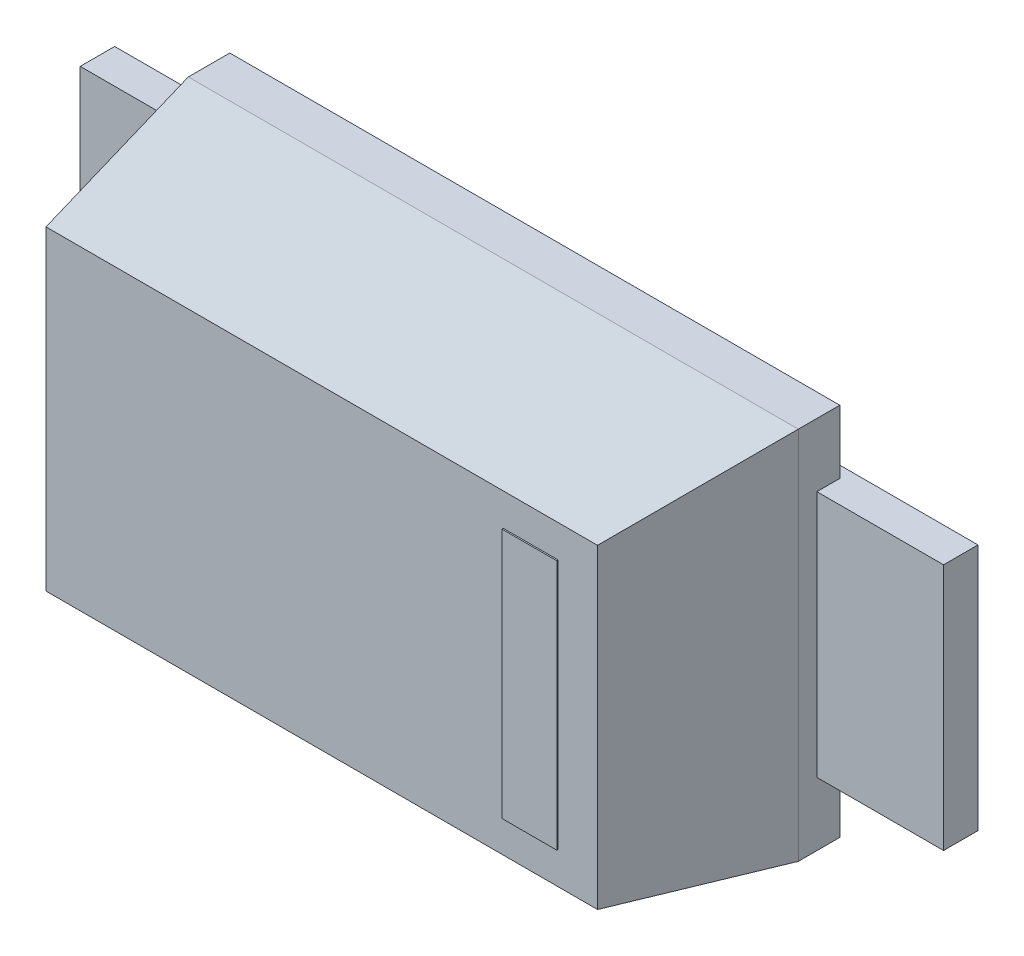
ISO-10303-21;
HEADER;
FILE_DESCRIPTION(('STEP AP214'),'2;1');
FILE_NAME('part.step','',(''),(''),'','','');
FILE_SCHEMA(('AUTOMOTIVE_DESIGN { 1 0 10303 214 1 1 1 1 }'));
ENDSEC;
DATA;
#1=APPLICATION_CONTEXT('core data for automotive mechanical design processes');
#2=APPLICATION_PROTOCOL_DEFINITION('international standard','automotive_design',2000,#1);
#3=PRODUCT_CONTEXT('',#1,'mechanical');
#4=PRODUCT('Part','Part','',(#3));
#5=PRODUCT_RELATED_PRODUCT_CATEGORY('part','',(#4));
#6=PRODUCT_DEFINITION_FORMATION('','',#4);
#7=PRODUCT_DEFINITION_CONTEXT('part definition',#1,'design');
#8=PRODUCT_DEFINITION('design','',#6,#7);
#9=PRODUCT_DEFINITION_SHAPE('','',#8);
#10=(LENGTH_UNIT() NAMED_UNIT(*) SI_UNIT(.MILLI.,.METRE.));
#11=(NAMED_UNIT(*) PLANE_ANGLE_UNIT() SI_UNIT($,.RADIAN.));
#12=(NAMED_UNIT(*) SI_UNIT($,.STERADIAN.) SOLID_ANGLE_UNIT());
#13=UNCERTAINTY_MEASURE_WITH_UNIT(LENGTH_MEASURE(1.E-05),#10,'distance_accuracy_value','');
#14=(GEOMETRIC_REPRESENTATION_CONTEXT(3) GLOBAL_UNCERTAINTY_ASSIGNED_CONTEXT((#13)) GLOBAL_UNIT_ASSIGNED_CONTEXT((#10,
#11,#12)) REPRESENTATION_CONTEXT('',''));
#15=CARTESIAN_POINT('',(0.,0.,0.));
#16=DIRECTION('',(0.,0.,1.));
#17=DIRECTION('',(1.,0.,0.));
#18=AXIS2_PLACEMENT_3D('',#15,#16,#17);
#19=CARTESIAN_POINT('',(0.801,-0.553,0.997));
#20=DIRECTION('',(0.,0.,1.));
#21=DIRECTION('',(1.,0.,0.));
#22=AXIS2_PLACEMENT_3D('',#19,#20,#21);
#23=PLANE('',#22);
#24=DIRECTION('',(1.,0.,0.));
#25=VECTOR('',#24,1.);
#26=CARTESIAN_POINT('',(0.801,-0.553,0.997));
#27=LINE('',#26,#25);
#28=CARTESIAN_POINT('',(0.801,-0.553,0.997));
#29=VERTEX_POINT('',#28);
#30=CARTESIAN_POINT('',(1.043,-0.553,0.997));
#31=VERTEX_POINT('',#30);
#32=EDGE_CURVE('P0_E71',#29,#31,#27,.T.);
#33=ORIENTED_EDGE('',*,*,#32,.T.);
#34=DIRECTION('',(0.,1.,0.));
#35=VECTOR('',#34,1.);
#36=CARTESIAN_POINT('',(1.043,-0.553,0.997));
#37=LINE('',#36,#35);
#38=CARTESIAN_POINT('',(1.043,0.553,0.997));
#39=VERTEX_POINT('',#38);
#40=EDGE_CURVE('P0_E100',#31,#39,#37,.T.);
#41=ORIENTED_EDGE('',*,*,#40,.T.);
#42=DIRECTION('',(-1.,0.,0.));
#43=VECTOR('',#42,1.);
#44=CARTESIAN_POINT('',(1.043,0.553,0.997));
#45=LINE('',#44,#43);
#46=CARTESIAN_POINT('',(0.801,0.553,0.997));
#47=VERTEX_POINT('',#46);
#48=EDGE_CURVE('P0_E73',#39,#47,#45,.T.);
#49=ORIENTED_EDGE('',*,*,#48,.T.);
#50=DIRECTION('',(0.,-1.,0.));
#51=VECTOR('',#50,1.);
#52=CARTESIAN_POINT('',(0.801,0.553,0.997));
#53=LINE('',#52,#51);
#54=EDGE_CURVE('P0_E11',#47,#29,#53,.T.);
#55=ORIENTED_EDGE('',*,*,#54,.T.);
#56=EDGE_LOOP('',(#33,#41,#49,#55));
#57=FACE_BOUND('',#56,.T.);
#58=ADVANCED_FACE('P0_F17',(#57),#23,.T.);
#59=CARTESIAN_POINT('',(0.801,0.553,0.991));
#60=DIRECTION('',(0.,0.,-1.));
#61=DIRECTION('',(0.,-1.,0.));
#62=AXIS2_PLACEMENT_3D('',#59,#60,#61);
#63=PLANE('',#62);
#64=DIRECTION('',(1.,0.,0.));
#65=VECTOR('',#64,1.);
#66=CARTESIAN_POINT('',(0.801,0.553,0.991));
#67=LINE('',#66,#65);
#68=CARTESIAN_POINT('',(0.801,0.553,0.991));
#69=VERTEX_POINT('',#68);
#70=CARTESIAN_POINT('',(1.043,0.553,0.991));
#71=VERTEX_POINT('',#70);
#72=EDGE_CURVE('P0_E101',#69,#71,#67,.T.);
#73=ORIENTED_EDGE('',*,*,#72,.T.);
#74=DIRECTION('',(0.,-1.,0.));
#75=VECTOR('',#74,1.);
#76=CARTESIAN_POINT('',(1.043,0.553,0.991));
#77=LINE('',#76,#75);
#78=CARTESIAN_POINT('',(1.043,-0.553,0.991));
#79=VERTEX_POINT('',#78);
#80=EDGE_CURVE('P0_E81',#71,#79,#77,.T.);
#81=ORIENTED_EDGE('',*,*,#80,.T.);
#82=DIRECTION('',(-1.,0.,0.));
#83=VECTOR('',#82,1.);
#84=CARTESIAN_POINT('',(1.043,-0.553,0.991));
#85=LINE('',#84,#83);
#86=CARTESIAN_POINT('',(0.801,-0.553,0.991));
#87=VERTEX_POINT('',#86);
#88=EDGE_CURVE('P0_E90',#79,#87,#85,.T.);
#89=ORIENTED_EDGE('',*,*,#88,.T.);
#90=DIRECTION('',(0.,1.,0.));
#91=VECTOR('',#90,1.);
#92=CARTESIAN_POINT('',(0.801,-0.553,0.991));
#93=LINE('',#92,#91);
#94=EDGE_CURVE('P0_E20',#87,#69,#93,.T.);
#95=ORIENTED_EDGE('',*,*,#94,.T.);
#96=EDGE_LOOP('',(#73,#81,#89,#95));
#97=FACE_BOUND('',#96,.T.);
#98=ADVANCED_FACE('P0_F121',(#97),#63,.T.);
#99=CARTESIAN_POINT('',(0.801,0.553,0.991));
#100=DIRECTION('',(-1.,0.,0.));
#101=DIRECTION('',(0.,0.,1.));
#102=AXIS2_PLACEMENT_3D('',#99,#100,#101);
#103=PLANE('',#102);
#104=ORIENTED_EDGE('',*,*,#94,.F.);
#105=DIRECTION('',(0.,0.,1.));
#106=VECTOR('',#105,1.);
#107=CARTESIAN_POINT('',(0.801,-0.553,0.991));
#108=LINE('',#107,#106);
#109=EDGE_CURVE('P0_E76',#87,#29,#108,.T.);
#110=ORIENTED_EDGE('',*,*,#109,.T.);
#111=ORIENTED_EDGE('',*,*,#54,.F.);
#112=DIRECTION('',(0.,0.,-1.));
#113=VECTOR('',#112,1.);
#114=CARTESIAN_POINT('',(0.801,0.553,0.997));
#115=LINE('',#114,#113);
#116=EDGE_CURVE('P0_E103',#47,#69,#115,.T.);
#117=ORIENTED_EDGE('',*,*,#116,.T.);
#118=EDGE_LOOP('',(#104,#110,#111,#117));
#119=FACE_BOUND('',#118,.T.);
#120=ADVANCED_FACE('P0_F77',(#119),#103,.T.);
#121=CARTESIAN_POINT('',(1.043,0.553,0.991));
#122=DIRECTION('',(0.,1.,0.));
#123=DIRECTION('',(1.,0.,0.));
#124=AXIS2_PLACEMENT_3D('',#121,#122,#123);
#125=PLANE('',#124);
#126=ORIENTED_EDGE('',*,*,#72,.F.);
#127=ORIENTED_EDGE('',*,*,#116,.F.);
#128=ORIENTED_EDGE('',*,*,#48,.F.);
#129=DIRECTION('',(0.,0.,-1.));
#130=VECTOR('',#129,1.);
#131=CARTESIAN_POINT('',(1.043,0.553,0.997));
#132=LINE('',#131,#130);
#133=EDGE_CURVE('P0_E96',#39,#71,#132,.T.);
#134=ORIENTED_EDGE('',*,*,#133,.T.);
#135=EDGE_LOOP('',(#126,#127,#128,#134));
#136=FACE_BOUND('',#135,.T.);
#137=ADVANCED_FACE('P0_F120',(#136),#125,.T.);
#138=CARTESIAN_POINT('',(1.043,-0.553,0.991));
#139=DIRECTION('',(1.,0.,0.));
#140=DIRECTION('',(0.,1.,0.));
#141=AXIS2_PLACEMENT_3D('',#138,#139,#140);
#142=PLANE('',#141);
#143=ORIENTED_EDGE('',*,*,#80,.F.);
#144=ORIENTED_EDGE('',*,*,#133,.F.);
#145=ORIENTED_EDGE('',*,*,#40,.F.);
#146=DIRECTION('',(0.,0.,-1.));
#147=VECTOR('',#146,1.);
#148=CARTESIAN_POINT('',(1.043,-0.553,0.997));
#149=LINE('',#148,#147);
#150=EDGE_CURVE('P0_E85',#31,#79,#149,.T.);
#151=ORIENTED_EDGE('',*,*,#150,.T.);
#152=EDGE_LOOP('',(#143,#144,#145,#151));
#153=FACE_BOUND('',#152,.T.);
#154=ADVANCED_FACE('P0_F118',(#153),#142,.T.);
#155=CARTESIAN_POINT('',(0.801,-0.553,0.991));
#156=DIRECTION('',(0.,-1.,0.));
#157=DIRECTION('',(0.,0.,-1.));
#158=AXIS2_PLACEMENT_3D('',#155,#156,#157);
#159=PLANE('',#158);
#160=ORIENTED_EDGE('',*,*,#88,.F.);
#161=ORIENTED_EDGE('',*,*,#150,.F.);
#162=ORIENTED_EDGE('',*,*,#32,.F.);
#163=ORIENTED_EDGE('',*,*,#109,.F.);
#164=EDGE_LOOP('',(#160,#161,#162,#163));
#165=FACE_BOUND('',#164,.T.);
#166=ADVANCED_FACE('P0_F83',(#165),#159,.T.);
#167=CLOSED_SHELL('',(#58,#98,#120,#137,#154,#166));
#168=MANIFOLD_SOLID_BREP('P0_B1',#167);
#169=CARTESIAN_POINT('',(-1.346,0.826,0.051));
#170=DIRECTION('',(-1.,0.,0.));
#171=DIRECTION('',(0.,0.,1.));
#172=AXIS2_PLACEMENT_3D('',#169,#170,#171);
#173=PLANE('',#172);
#174=DIRECTION('',(0.,-1.,0.));
#175=VECTOR('',#174,1.);
#176=CARTESIAN_POINT('',(-1.346,0.826,0.051));
#177=LINE('',#176,#175);
#178=CARTESIAN_POINT('',(-1.346,0.826,0.051));
#179=VERTEX_POINT('',#178);
#180=CARTESIAN_POINT('',(-1.346,-0.826,0.051));
#181=VERTEX_POINT('',#180);
#182=EDGE_CURVE('P1_E87',#179,#181,#177,.T.);
#183=ORIENTED_EDGE('',*,*,#182,.T.);
#184=DIRECTION('',(0.,0.,1.));
#185=VECTOR('',#184,1.);
#186=CARTESIAN_POINT('',(-1.346,-0.826,0.051));
#187=LINE('',#186,#185);
#188=CARTESIAN_POINT('',(-1.346,-0.826,0.234));
#189=VERTEX_POINT('',#188);
#190=EDGE_CURVE('P1_E82',#181,#189,#187,.T.);
#191=ORIENTED_EDGE('',*,*,#190,.T.);
#192=DIRECTION('',(0.,1.,0.));
#193=VECTOR('',#192,1.);
#194=CARTESIAN_POINT('',(-1.346,-0.826,0.234));
#195=LINE('',#194,#193);
#196=CARTESIAN_POINT('',(-1.346,0.826,0.234));
#197=VERTEX_POINT('',#196);
#198=EDGE_CURVE('P1_E84',#189,#197,#195,.T.);
#199=ORIENTED_EDGE('',*,*,#198,.T.);
#200=DIRECTION('',(0.,0.,-1.));
#201=VECTOR('',#200,1.);
#202=CARTESIAN_POINT('',(-1.346,0.826,0.234));
#203=LINE('',#202,#201);
#204=EDGE_CURVE('P1_E11',#197,#179,#203,.T.);
#205=ORIENTED_EDGE('',*,*,#204,.T.);
#206=EDGE_LOOP('',(#183,#191,#199,#205));
#207=FACE_BOUND('',#206,.T.);
#208=ADVANCED_FACE('P1_F17',(#207),#173,.T.);
#209=CARTESIAN_POINT('',(1.346,0.826,0.051));
#210=DIRECTION('',(0.,1.,0.));
#211=DIRECTION('',(1.,0.,0.));
#212=AXIS2_PLACEMENT_3D('',#209,#210,#211);
#213=PLANE('',#212);
#214=DIRECTION('',(-1.,0.,0.));
#215=VECTOR('',#214,1.);
#216=CARTESIAN_POINT('',(1.346,0.826,0.051));
#217=LINE('',#216,#215);
#218=CARTESIAN_POINT('',(1.346,0.826,0.051));
#219=VERTEX_POINT('',#218);
#220=EDGE_CURVE('P1_E284',#219,#179,#217,.T.);
#221=ORIENTED_EDGE('',*,*,#220,.T.);
#222=ORIENTED_EDGE('',*,*,#204,.F.);
#223=DIRECTION('',(1.,0.,0.));
#224=VECTOR('',#223,1.);
#225=CARTESIAN_POINT('',(-1.346,0.826,0.234));
#226=LINE('',#225,#224);
#227=CARTESIAN_POINT('',(1.346,0.826,0.234));
#228=VERTEX_POINT('',#227);
#229=EDGE_CURVE('P1_E301',#197,#228,#226,.T.);
#230=ORIENTED_EDGE('',*,*,#229,.T.);
#231=DIRECTION('',(0.,0.,-1.));
#232=VECTOR('',#231,1.);
#233=CARTESIAN_POINT('',(1.346,0.826,0.234));
#234=LINE('',#233,#232);
#235=EDGE_CURVE('P1_E29',#228,#219,#234,.T.);
#236=ORIENTED_EDGE('',*,*,#235,.T.);
#237=EDGE_LOOP('',(#221,#222,#230,#236));
#238=FACE_BOUND('',#237,.T.);
#239=ADVANCED_FACE('P1_F329',(#238),#213,.T.);
#240=CARTESIAN_POINT('',(1.346,-0.826,0.051));
#241=DIRECTION('',(1.,0.,0.));
#242=DIRECTION('',(0.,1.,0.));
#243=AXIS2_PLACEMENT_3D('',#240,#241,#242);
#244=PLANE('',#243);
#245=DIRECTION('',(0.,1.,0.));
#246=VECTOR('',#245,1.);
#247=CARTESIAN_POINT('',(1.346,-0.826,0.051));
#248=LINE('',#247,#246);
#249=CARTESIAN_POINT('',(1.346,-0.826,0.051));
#250=VERTEX_POINT('',#249);
#251=EDGE_CURVE('P1_E288',#250,#219,#248,.T.);
#252=ORIENTED_EDGE('',*,*,#251,.T.);
#253=ORIENTED_EDGE('',*,*,#235,.F.);
#254=DIRECTION('',(0.,-1.,0.));
#255=VECTOR('',#254,1.);
#256=CARTESIAN_POINT('',(1.346,0.826,0.234));
#257=LINE('',#256,#255);
#258=CARTESIAN_POINT('',(1.346,-0.826,0.234));
#259=VERTEX_POINT('',#258);
#260=EDGE_CURVE('P1_E118',#228,#259,#257,.T.);
#261=ORIENTED_EDGE('',*,*,#260,.T.);
#262=DIRECTION('',(0.,0.,-1.));
#263=VECTOR('',#262,1.);
#264=CARTESIAN_POINT('',(1.346,-0.826,0.234));
#265=LINE('',#264,#263);
#266=EDGE_CURVE('P1_E93',#259,#250,#265,.T.);
#267=ORIENTED_EDGE('',*,*,#266,.T.);
#268=EDGE_LOOP('',(#252,#253,#261,#267));
#269=FACE_BOUND('',#268,.T.);
#270=ADVANCED_FACE('P1_F318',(#269),#244,.T.);
#271=CARTESIAN_POINT('',(-1.346,-0.826,0.051));
#272=DIRECTION('',(0.,-1.,0.));
#273=DIRECTION('',(0.,0.,-1.));
#274=AXIS2_PLACEMENT_3D('',#271,#272,#273);
#275=PLANE('',#274);
#276=DIRECTION('',(1.,0.,0.));
#277=VECTOR('',#276,1.);
#278=CARTESIAN_POINT('',(-1.346,-0.826,0.051));
#279=LINE('',#278,#277);
#280=EDGE_CURVE('P1_E132',#181,#250,#279,.T.);
#281=ORIENTED_EDGE('',*,*,#280,.T.);
#282=ORIENTED_EDGE('',*,*,#266,.F.);
#283=DIRECTION('',(-1.,0.,0.));
#284=VECTOR('',#283,1.);
#285=CARTESIAN_POINT('',(1.346,-0.826,0.234));
#286=LINE('',#285,#284);
#287=EDGE_CURVE('P1_E113',#259,#189,#286,.T.);
#288=ORIENTED_EDGE('',*,*,#287,.T.);
#289=ORIENTED_EDGE('',*,*,#190,.F.);
#290=EDGE_LOOP('',(#281,#282,#288,#289));
#291=FACE_BOUND('',#290,.T.);
#292=ADVANCED_FACE('P1_F122',(#291),#275,.T.);
#293=CARTESIAN_POINT('',(-1.346,0.826,0.234));
#294=DIRECTION('',(-0.985627010751298,0.,0.168936069794051));
#295=DIRECTION('',(0.,1.,0.));
#296=AXIS2_PLACEMENT_3D('',#293,#294,#295);
#297=PLANE('',#296);
#298=ORIENTED_EDGE('',*,*,#198,.F.);
#299=CARTESIAN_POINT('',(-1.346,-0.826,0.234));
#300=DIRECTION('',(0.166591962643217,0.166008661744033,0.971950740628678));
#301=VECTOR('',#300,1.);
#302=LINE('',#299,#301);
#303=CARTESIAN_POINT('',(-1.217,-0.696,0.991));
#304=VERTEX_POINT('',#303);
#305=EDGE_CURVE('P1_E99',#189,#304,#302,.T.);
#306=ORIENTED_EDGE('',*,*,#305,.T.);
#307=CARTESIAN_POINT('',(-1.21627189717387,-0.696,0.990875203470977));
#308=DIRECTION('',(0.,1.,0.));
#309=VECTOR('',#308,1.);
#310=LINE('',#307,#309);
#311=CARTESIAN_POINT('',(-1.217,0.696,0.991));
#312=VERTEX_POINT('',#311);
#313=EDGE_CURVE('P1_E211',#304,#312,#310,.T.);
#314=ORIENTED_EDGE('',*,*,#313,.T.);
#315=CARTESIAN_POINT('',(-1.21627189717387,0.696,0.990875203470977));
#316=DIRECTION('',(-0.166591962643217,0.166008661744034,-0.971950740628678));
#317=VECTOR('',#316,1.);
#318=LINE('',#315,#317);
#319=EDGE_CURVE('P1_E102',#312,#197,#318,.T.);
#320=ORIENTED_EDGE('',*,*,#319,.T.);
#321=EDGE_LOOP('',(#298,#306,#314,#320));
#322=FACE_BOUND('',#321,.T.);
#323=ADVANCED_FACE('P1_F97',(#322),#297,.T.);
#324=CARTESIAN_POINT('',(1.346,0.826,0.234));
#325=DIRECTION('',(0.,0.985627010751298,0.168936069794051));
#326=DIRECTION('',(1.,0.,0.));
#327=AXIS2_PLACEMENT_3D('',#324,#325,#326);
#328=PLANE('',#327);
#329=ORIENTED_EDGE('',*,*,#229,.F.);
#330=ORIENTED_EDGE('',*,*,#319,.F.);
#331=CARTESIAN_POINT('',(-1.217,0.696243357778189,0.991041711424456));
#332=DIRECTION('',(1.,0.,0.));
#333=VECTOR('',#332,1.);
#334=LINE('',#331,#333);
#335=CARTESIAN_POINT('',(1.217,0.696,0.991));
#336=VERTEX_POINT('',#335);
#337=EDGE_CURVE('P1_E235',#312,#336,#334,.T.);
#338=ORIENTED_EDGE('',*,*,#337,.T.);
#339=CARTESIAN_POINT('',(1.217,0.696243357778189,0.991041711424456));
#340=DIRECTION('',(0.166008661744034,0.166591962643217,-0.971950740628678));
#341=VECTOR('',#340,1.);
#342=LINE('',#339,#341);
#343=EDGE_CURVE('P1_E304',#336,#228,#342,.T.);
#344=ORIENTED_EDGE('',*,*,#343,.T.);
#345=EDGE_LOOP('',(#329,#330,#338,#344));
#346=FACE_BOUND('',#345,.T.);
#347=ADVANCED_FACE('P1_F153',(#346),#328,.T.);
#348=CARTESIAN_POINT('',(1.346,-0.826,0.234));
#349=DIRECTION('',(0.985627010751298,0.,0.168936069794051));
#350=DIRECTION('',(0.,-1.,0.));
#351=AXIS2_PLACEMENT_3D('',#348,#349,#350);
#352=PLANE('',#351);
#353=ORIENTED_EDGE('',*,*,#260,.F.);
#354=ORIENTED_EDGE('',*,*,#343,.F.);
#355=CARTESIAN_POINT('',(1.21627189717387,0.696,0.990875203470977));
#356=DIRECTION('',(0.,-1.,0.));
#357=VECTOR('',#356,1.);
#358=LINE('',#355,#357);
#359=CARTESIAN_POINT('',(1.217,-0.696,0.991));
#360=VERTEX_POINT('',#359);
#361=EDGE_CURVE('P1_E254',#336,#360,#358,.T.);
#362=ORIENTED_EDGE('',*,*,#361,.T.);
#363=CARTESIAN_POINT('',(1.21627189717387,-0.696,0.990875203470977));
#364=DIRECTION('',(0.166591962643217,-0.166008661744034,-0.971950740628678));
#365=VECTOR('',#364,1.);
#366=LINE('',#363,#365);
#367=EDGE_CURVE('P1_E119',#360,#259,#366,.T.);
#368=ORIENTED_EDGE('',*,*,#367,.T.);
#369=EDGE_LOOP('',(#353,#354,#362,#368));
#370=FACE_BOUND('',#369,.T.);
#371=ADVANCED_FACE('P1_F174',(#370),#352,.T.);
#372=CARTESIAN_POINT('',(-1.346,-0.826,0.234));
#373=DIRECTION('',(0.,-0.985627010751298,0.168936069794051));
#374=DIRECTION('',(-1.,0.,0.));
#375=AXIS2_PLACEMENT_3D('',#372,#373,#374);
#376=PLANE('',#375);
#377=ORIENTED_EDGE('',*,*,#287,.F.);
#378=ORIENTED_EDGE('',*,*,#367,.F.);
#379=CARTESIAN_POINT('',(1.217,-0.696243357778189,0.991041711424456));
#380=DIRECTION('',(-1.,0.,0.));
#381=VECTOR('',#380,1.);
#382=LINE('',#379,#381);
#383=EDGE_CURVE('P1_E115',#360,#304,#382,.T.);
#384=ORIENTED_EDGE('',*,*,#383,.T.);
#385=ORIENTED_EDGE('',*,*,#305,.F.);
#386=EDGE_LOOP('',(#377,#378,#384,#385));
#387=FACE_BOUND('',#386,.T.);
#388=ADVANCED_FACE('P1_F111',(#387),#376,.T.);
#389=CARTESIAN_POINT('',(-1.346,0.826,0.051));
#390=DIRECTION('',(0.,0.,-1.));
#391=DIRECTION('',(0.,-1.,0.));
#392=AXIS2_PLACEMENT_3D('',#389,#390,#391);
#393=PLANE('',#392);
#394=ORIENTED_EDGE('',*,*,#220,.F.);
#395=ORIENTED_EDGE('',*,*,#251,.F.);
#396=ORIENTED_EDGE('',*,*,#280,.F.);
#397=ORIENTED_EDGE('',*,*,#182,.F.);
#398=EDGE_LOOP('',(#394,#395,#396,#397));
#399=FACE_BOUND('',#398,.T.);
#400=ADVANCED_FACE('P1_F156',(#399),#393,.T.);
#401=CARTESIAN_POINT('',(-1.217,-0.696,0.991));
#402=DIRECTION('',(0.,0.,1.));
#403=DIRECTION('',(1.,0.,0.));
#404=AXIS2_PLACEMENT_3D('',#401,#402,#403);
#405=PLANE('',#404);
#406=ORIENTED_EDGE('',*,*,#383,.F.);
#407=ORIENTED_EDGE('',*,*,#361,.F.);
#408=ORIENTED_EDGE('',*,*,#337,.F.);
#409=ORIENTED_EDGE('',*,*,#313,.F.);
#410=EDGE_LOOP('',(#406,#407,#408,#409));
#411=FACE_BOUND('',#410,.T.);
#412=ADVANCED_FACE('P1_F154',(#411),#405,.T.);
#413=CLOSED_SHELL('',(#208,#239,#270,#292,#323,#347,#371,#388,#400,#412));
#414=MANIFOLD_SOLID_BREP('P1_B1',#413);
#415=CARTESIAN_POINT('',(-1.905,0.546,0.));
#416=DIRECTION('',(0.,0.,-1.));
#417=DIRECTION('',(0.,-1.,0.));
#418=AXIS2_PLACEMENT_3D('',#415,#416,#417);
#419=PLANE('',#418);
#420=DIRECTION('',(1.,0.,0.));
#421=VECTOR('',#420,1.);
#422=CARTESIAN_POINT('',(-1.905,0.546,0.));
#423=LINE('',#422,#421);
#424=CARTESIAN_POINT('',(-1.905,0.546,0.));
#425=VERTEX_POINT('',#424);
#426=CARTESIAN_POINT('',(-0.965,0.546,0.));
#427=VERTEX_POINT('',#426);
#428=EDGE_CURVE('P2_E103',#425,#427,#423,.T.);
#429=ORIENTED_EDGE('',*,*,#428,.T.);
#430=DIRECTION('',(0.,-1.,0.));
#431=VECTOR('',#430,1.);
#432=CARTESIAN_POINT('',(-0.965,0.546,0.));
#433=LINE('',#432,#431);
#434=CARTESIAN_POINT('',(-0.965,-0.546,0.));
#435=VERTEX_POINT('',#434);
#436=EDGE_CURVE('P2_E11',#427,#435,#433,.T.);
#437=ORIENTED_EDGE('',*,*,#436,.T.);
#438=DIRECTION('',(-1.,0.,0.));
#439=VECTOR('',#438,1.);
#440=CARTESIAN_POINT('',(-0.965,-0.546,0.));
#441=LINE('',#440,#439);
#442=CARTESIAN_POINT('',(-1.905,-0.546,0.));
#443=VERTEX_POINT('',#442);
#444=EDGE_CURVE('P2_E101',#435,#443,#441,.T.);
#445=ORIENTED_EDGE('',*,*,#444,.T.);
#446=DIRECTION('',(0.,1.,0.));
#447=VECTOR('',#446,1.);
#448=CARTESIAN_POINT('',(-1.905,-0.546,0.));
#449=LINE('',#448,#447);
#450=EDGE_CURVE('P2_E26',#443,#425,#449,.T.);
#451=ORIENTED_EDGE('',*,*,#450,.T.);
#452=EDGE_LOOP('',(#429,#437,#445,#451));
#453=FACE_BOUND('',#452,.T.);
#454=ADVANCED_FACE('P2_F17',(#453),#419,.T.);
#455=CARTESIAN_POINT('',(-1.346,-0.546,0.051));
#456=DIRECTION('',(1.,0.,0.));
#457=DIRECTION('',(0.,1.,0.));
#458=AXIS2_PLACEMENT_3D('',#455,#456,#457);
#459=PLANE('',#458);
#460=DIRECTION('',(0.,1.,0.));
#461=VECTOR('',#460,1.);
#462=CARTESIAN_POINT('',(-1.346,-0.546,0.051));
#463=LINE('',#462,#461);
#464=CARTESIAN_POINT('',(-1.346,-0.546,0.051));
#465=VERTEX_POINT('',#464);
#466=CARTESIAN_POINT('',(-1.346,0.546,0.051));
#467=VERTEX_POINT('',#466);
#468=EDGE_CURVE('P2_E50',#465,#467,#463,.T.);
#469=ORIENTED_EDGE('',*,*,#468,.T.);
#470=DIRECTION('',(0.,0.,1.));
#471=VECTOR('',#470,1.);
#472=CARTESIAN_POINT('',(-1.346,0.546,0.051));
#473=LINE('',#472,#471);
#474=CARTESIAN_POINT('',(-1.346,0.546,0.152));
#475=VERTEX_POINT('',#474);
#476=EDGE_CURVE('P2_E121',#467,#475,#473,.T.);
#477=ORIENTED_EDGE('',*,*,#476,.T.);
#478=DIRECTION('',(0.,-1.,0.));
#479=VECTOR('',#478,1.);
#480=CARTESIAN_POINT('',(-1.346,0.546,0.152));
#481=LINE('',#480,#479);
#482=CARTESIAN_POINT('',(-1.346,-0.546,0.152));
#483=VERTEX_POINT('',#482);
#484=EDGE_CURVE('P2_E150',#475,#483,#481,.T.);
#485=ORIENTED_EDGE('',*,*,#484,.T.);
#486=DIRECTION('',(0.,0.,-1.));
#487=VECTOR('',#486,1.);
#488=CARTESIAN_POINT('',(-1.346,-0.546,0.152));
#489=LINE('',#488,#487);
#490=EDGE_CURVE('P2_E127',#483,#465,#489,.T.);
#491=ORIENTED_EDGE('',*,*,#490,.T.);
#492=EDGE_LOOP('',(#469,#477,#485,#491));
#493=FACE_BOUND('',#492,.T.);
#494=ADVANCED_FACE('P2_F19',(#493),#459,.T.);
#495=CARTESIAN_POINT('',(-0.965,-0.546,0.));
#496=DIRECTION('',(1.,0.,0.));
#497=DIRECTION('',(0.,1.,0.));
#498=AXIS2_PLACEMENT_3D('',#495,#496,#497);
#499=PLANE('',#498);
#500=ORIENTED_EDGE('',*,*,#436,.F.);
#501=DIRECTION('',(0.,0.,1.));
#502=VECTOR('',#501,1.);
#503=CARTESIAN_POINT('',(-0.965,0.546,0.));
#504=LINE('',#503,#502);
#505=CARTESIAN_POINT('',(-0.965,0.546,0.051));
#506=VERTEX_POINT('',#505);
#507=EDGE_CURVE('P2_E147',#427,#506,#504,.T.);
#508=ORIENTED_EDGE('',*,*,#507,.T.);
#509=DIRECTION('',(0.,-1.,0.));
#510=VECTOR('',#509,1.);
#511=CARTESIAN_POINT('',(-0.965,0.546,0.051));
#512=LINE('',#511,#510);
#513=CARTESIAN_POINT('',(-0.965,-0.546,0.051));
#514=VERTEX_POINT('',#513);
#515=EDGE_CURVE('P2_E38',#506,#514,#512,.T.);
#516=ORIENTED_EDGE('',*,*,#515,.T.);
#517=DIRECTION('',(0.,0.,-1.));
#518=VECTOR('',#517,1.);
#519=CARTESIAN_POINT('',(-0.965,-0.546,0.051));
#520=LINE('',#519,#518);
#521=EDGE_CURVE('P2_E105',#514,#435,#520,.T.);
#522=ORIENTED_EDGE('',*,*,#521,.T.);
#523=EDGE_LOOP('',(#500,#508,#516,#522));
#524=FACE_BOUND('',#523,.T.);
#525=ADVANCED_FACE('P2_F106',(#524),#499,.T.);
#526=CARTESIAN_POINT('',(-1.905,0.546,0.));
#527=DIRECTION('',(-1.,0.,0.));
#528=DIRECTION('',(0.,0.,1.));
#529=AXIS2_PLACEMENT_3D('',#526,#527,#528);
#530=PLANE('',#529);
#531=ORIENTED_EDGE('',*,*,#450,.F.);
#532=DIRECTION('',(0.,0.,1.));
#533=VECTOR('',#532,1.);
#534=CARTESIAN_POINT('',(-1.905,-0.546,0.));
#535=LINE('',#534,#533);
#536=CARTESIAN_POINT('',(-1.905,-0.546,0.152));
#537=VERTEX_POINT('',#536);
#538=EDGE_CURVE('P2_E115',#443,#537,#535,.T.);
#539=ORIENTED_EDGE('',*,*,#538,.T.);
#540=DIRECTION('',(0.,1.,0.));
#541=VECTOR('',#540,1.);
#542=CARTESIAN_POINT('',(-1.905,-0.546,0.152));
#543=LINE('',#542,#541);
#544=CARTESIAN_POINT('',(-1.905,0.546,0.152));
#545=VERTEX_POINT('',#544);
#546=EDGE_CURVE('P2_E64',#537,#545,#543,.T.);
#547=ORIENTED_EDGE('',*,*,#546,.T.);
#548=DIRECTION('',(0.,0.,-1.));
#549=VECTOR('',#548,1.);
#550=CARTESIAN_POINT('',(-1.905,0.546,0.152));
#551=LINE('',#550,#549);
#552=EDGE_CURVE('P2_E140',#545,#425,#551,.T.);
#553=ORIENTED_EDGE('',*,*,#552,.T.);
#554=EDGE_LOOP('',(#531,#539,#547,#553));
#555=FACE_BOUND('',#554,.T.);
#556=ADVANCED_FACE('P2_F202',(#555),#530,.T.);
#557=CARTESIAN_POINT('',(-1.346,-0.546,0.051));
#558=DIRECTION('',(0.,0.,1.));
#559=DIRECTION('',(1.,0.,0.));
#560=AXIS2_PLACEMENT_3D('',#557,#558,#559);
#561=PLANE('',#560);
#562=DIRECTION('',(1.,0.,0.));
#563=VECTOR('',#562,1.);
#564=CARTESIAN_POINT('',(-1.346,-0.546,0.051));
#565=LINE('',#564,#563);
#566=EDGE_CURVE('P2_E110',#465,#514,#565,.T.);
#567=ORIENTED_EDGE('',*,*,#566,.T.);
#568=ORIENTED_EDGE('',*,*,#515,.F.);
#569=DIRECTION('',(-1.,0.,0.));
#570=VECTOR('',#569,1.);
#571=CARTESIAN_POINT('',(-0.965,0.546,0.051));
#572=LINE('',#571,#570);
#573=EDGE_CURVE('P2_E122',#506,#467,#572,.T.);
#574=ORIENTED_EDGE('',*,*,#573,.T.);
#575=ORIENTED_EDGE('',*,*,#468,.F.);
#576=EDGE_LOOP('',(#567,#568,#574,#575));
#577=FACE_BOUND('',#576,.T.);
#578=ADVANCED_FACE('P2_F191',(#577),#561,.T.);
#579=CARTESIAN_POINT('',(-1.905,-0.546,0.152));
#580=DIRECTION('',(0.,0.,1.));
#581=DIRECTION('',(1.,0.,0.));
#582=AXIS2_PLACEMENT_3D('',#579,#580,#581);
#583=PLANE('',#582);
#584=DIRECTION('',(1.,0.,0.));
#585=VECTOR('',#584,1.);
#586=CARTESIAN_POINT('',(-1.905,-0.546,0.152));
#587=LINE('',#586,#585);
#588=EDGE_CURVE('P2_E130',#537,#483,#587,.T.);
#589=ORIENTED_EDGE('',*,*,#588,.T.);
#590=ORIENTED_EDGE('',*,*,#484,.F.);
#591=DIRECTION('',(-1.,0.,0.));
#592=VECTOR('',#591,1.);
#593=CARTESIAN_POINT('',(-1.346,0.546,0.152));
#594=LINE('',#593,#592);
#595=EDGE_CURVE('P2_E123',#475,#545,#594,.T.);
#596=ORIENTED_EDGE('',*,*,#595,.T.);
#597=ORIENTED_EDGE('',*,*,#546,.F.);
#598=EDGE_LOOP('',(#589,#590,#596,#597));
#599=FACE_BOUND('',#598,.T.);
#600=ADVANCED_FACE('P2_F180',(#599),#583,.T.);
#601=CARTESIAN_POINT('',(-0.965,0.546,0.));
#602=DIRECTION('',(0.,1.,0.));
#603=DIRECTION('',(1.,0.,0.));
#604=AXIS2_PLACEMENT_3D('',#601,#602,#603);
#605=PLANE('',#604);
#606=ORIENTED_EDGE('',*,*,#428,.F.);
#607=ORIENTED_EDGE('',*,*,#552,.F.);
#608=ORIENTED_EDGE('',*,*,#595,.F.);
#609=ORIENTED_EDGE('',*,*,#476,.F.);
#610=ORIENTED_EDGE('',*,*,#573,.F.);
#611=ORIENTED_EDGE('',*,*,#507,.F.);
#612=EDGE_LOOP('',(#606,#607,#608,#609,#610,#611));
#613=FACE_BOUND('',#612,.T.);
#614=ADVANCED_FACE('P2_F168',(#613),#605,.T.);
#615=CARTESIAN_POINT('',(-1.905,-0.546,0.));
#616=DIRECTION('',(0.,-1.,0.));
#617=DIRECTION('',(0.,0.,-1.));
#618=AXIS2_PLACEMENT_3D('',#615,#616,#617);
#619=PLANE('',#618);
#620=ORIENTED_EDGE('',*,*,#444,.F.);
#621=ORIENTED_EDGE('',*,*,#521,.F.);
#622=ORIENTED_EDGE('',*,*,#566,.F.);
#623=ORIENTED_EDGE('',*,*,#490,.F.);
#624=ORIENTED_EDGE('',*,*,#588,.F.);
#625=ORIENTED_EDGE('',*,*,#538,.F.);
#626=EDGE_LOOP('',(#620,#621,#622,#623,#624,#625));
#627=FACE_BOUND('',#626,.T.);
#628=ADVANCED_FACE('P2_F113',(#627),#619,.T.);
#629=CLOSED_SHELL('',(#454,#494,#525,#556,#578,#600,#614,#628));
#630=MANIFOLD_SOLID_BREP('P2_B1',#629);
#631=CARTESIAN_POINT('',(1.905,-0.546,0.));
#632=DIRECTION('',(0.,0.,-1.));
#633=DIRECTION('',(0.,-1.,0.));
#634=AXIS2_PLACEMENT_3D('',#631,#632,#633);
#635=PLANE('',#634);
#636=DIRECTION('',(-1.,0.,0.));
#637=VECTOR('',#636,1.);
#638=CARTESIAN_POINT('',(1.905,-0.546,0.));
#639=LINE('',#638,#637);
#640=CARTESIAN_POINT('',(1.905,-0.546,0.));
#641=VERTEX_POINT('',#640);
#642=CARTESIAN_POINT('',(0.965,-0.546,0.));
#643=VERTEX_POINT('',#642);
#644=EDGE_CURVE('P3_E97',#641,#643,#639,.T.);
#645=ORIENTED_EDGE('',*,*,#644,.T.);
#646=DIRECTION('',(0.,1.,0.));
#647=VECTOR('',#646,1.);
#648=CARTESIAN_POINT('',(0.965,-0.546,0.));
#649=LINE('',#648,#647);
#650=CARTESIAN_POINT('',(0.965,0.546,0.));
#651=VERTEX_POINT('',#650);
#652=EDGE_CURVE('P3_E11',#643,#651,#649,.T.);
#653=ORIENTED_EDGE('',*,*,#652,.T.);
#654=DIRECTION('',(1.,0.,0.));
#655=VECTOR('',#654,1.);
#656=CARTESIAN_POINT('',(0.965,0.546,0.));
#657=LINE('',#656,#655);
#658=CARTESIAN_POINT('',(1.905,0.546,0.));
#659=VERTEX_POINT('',#658);
#660=EDGE_CURVE('P3_E95',#651,#659,#657,.T.);
#661=ORIENTED_EDGE('',*,*,#660,.T.);
#662=DIRECTION('',(0.,-1.,0.));
#663=VECTOR('',#662,1.);
#664=CARTESIAN_POINT('',(1.905,0.546,0.));
#665=LINE('',#664,#663);
#666=EDGE_CURVE('P3_E27',#659,#641,#665,.T.);
#667=ORIENTED_EDGE('',*,*,#666,.T.);
#668=EDGE_LOOP('',(#645,#653,#661,#667));
#669=FACE_BOUND('',#668,.T.);
#670=ADVANCED_FACE('P3_F17',(#669),#635,.T.);
#671=CARTESIAN_POINT('',(1.346,0.546,0.051));
#672=DIRECTION('',(-1.,0.,0.));
#673=DIRECTION('',(0.,0.,1.));
#674=AXIS2_PLACEMENT_3D('',#671,#672,#673);
#675=PLANE('',#674);
#676=DIRECTION('',(0.,-1.,0.));
#677=VECTOR('',#676,1.);
#678=CARTESIAN_POINT('',(1.346,0.546,0.051));
#679=LINE('',#678,#677);
#680=CARTESIAN_POINT('',(1.346,0.546,0.051));
#681=VERTEX_POINT('',#680);
#682=CARTESIAN_POINT('',(1.346,-0.546,0.051));
#683=VERTEX_POINT('',#682);
#684=EDGE_CURVE('P3_E145',#681,#683,#679,.T.);
#685=ORIENTED_EDGE('',*,*,#684,.T.);
#686=DIRECTION('',(0.,0.,1.));
#687=VECTOR('',#686,1.);
#688=CARTESIAN_POINT('',(1.346,-0.546,0.051));
#689=LINE('',#688,#687);
#690=CARTESIAN_POINT('',(1.346,-0.546,0.152));
#691=VERTEX_POINT('',#690);
#692=EDGE_CURVE('P3_E116',#683,#691,#689,.T.);
#693=ORIENTED_EDGE('',*,*,#692,.T.);
#694=DIRECTION('',(0.,1.,0.));
#695=VECTOR('',#694,1.);
#696=CARTESIAN_POINT('',(1.346,-0.546,0.152));
#697=LINE('',#696,#695);
#698=CARTESIAN_POINT('',(1.346,0.546,0.152));
#699=VERTEX_POINT('',#698);
#700=EDGE_CURVE('P3_E139',#691,#699,#697,.T.);
#701=ORIENTED_EDGE('',*,*,#700,.T.);
#702=DIRECTION('',(0.,0.,-1.));
#703=VECTOR('',#702,1.);
#704=CARTESIAN_POINT('',(1.346,0.546,0.152));
#705=LINE('',#704,#703);
#706=EDGE_CURVE('P3_E126',#699,#681,#705,.T.);
#707=ORIENTED_EDGE('',*,*,#706,.T.);
#708=EDGE_LOOP('',(#685,#693,#701,#707));
#709=FACE_BOUND('',#708,.T.);
#710=ADVANCED_FACE('P3_F19',(#709),#675,.T.);
#711=CARTESIAN_POINT('',(0.965,0.546,0.));
#712=DIRECTION('',(-1.,0.,0.));
#713=DIRECTION('',(0.,0.,1.));
#714=AXIS2_PLACEMENT_3D('',#711,#712,#713);
#715=PLANE('',#714);
#716=ORIENTED_EDGE('',*,*,#652,.F.);
#717=DIRECTION('',(0.,0.,1.));
#718=VECTOR('',#717,1.);
#719=CARTESIAN_POINT('',(0.965,-0.546,0.));
#720=LINE('',#719,#718);
#721=CARTESIAN_POINT('',(0.965,-0.546,0.051));
#722=VERTEX_POINT('',#721);
#723=EDGE_CURVE('P3_E123',#643,#722,#720,.T.);
#724=ORIENTED_EDGE('',*,*,#723,.T.);
#725=DIRECTION('',(0.,1.,0.));
#726=VECTOR('',#725,1.);
#727=CARTESIAN_POINT('',(0.965,-0.546,0.051));
#728=LINE('',#727,#726);
#729=CARTESIAN_POINT('',(0.965,0.546,0.051));
#730=VERTEX_POINT('',#729);
#731=EDGE_CURVE('P3_E39',#722,#730,#728,.T.);
#732=ORIENTED_EDGE('',*,*,#731,.T.);
#733=DIRECTION('',(0.,0.,-1.));
#734=VECTOR('',#733,1.);
#735=CARTESIAN_POINT('',(0.965,0.546,0.051));
#736=LINE('',#735,#734);
#737=EDGE_CURVE('P3_E99',#730,#651,#736,.T.);
#738=ORIENTED_EDGE('',*,*,#737,.T.);
#739=EDGE_LOOP('',(#716,#724,#732,#738));
#740=FACE_BOUND('',#739,.T.);
#741=ADVANCED_FACE('P3_F100',(#740),#715,.T.);
#742=CARTESIAN_POINT('',(1.905,-0.546,0.));
#743=DIRECTION('',(1.,0.,0.));
#744=DIRECTION('',(0.,1.,0.));
#745=AXIS2_PLACEMENT_3D('',#742,#743,#744);
#746=PLANE('',#745);
#747=ORIENTED_EDGE('',*,*,#666,.F.);
#748=DIRECTION('',(0.,0.,1.));
#749=VECTOR('',#748,1.);
#750=CARTESIAN_POINT('',(1.905,0.546,0.));
#751=LINE('',#750,#749);
#752=CARTESIAN_POINT('',(1.905,0.546,0.152));
#753=VERTEX_POINT('',#752);
#754=EDGE_CURVE('P3_E108',#659,#753,#751,.T.);
#755=ORIENTED_EDGE('',*,*,#754,.T.);
#756=DIRECTION('',(0.,-1.,0.));
#757=VECTOR('',#756,1.);
#758=CARTESIAN_POINT('',(1.905,0.546,0.152));
#759=LINE('',#758,#757);
#760=CARTESIAN_POINT('',(1.905,-0.546,0.152));
#761=VERTEX_POINT('',#760);
#762=EDGE_CURVE('P3_E68',#753,#761,#759,.T.);
#763=ORIENTED_EDGE('',*,*,#762,.T.);
#764=DIRECTION('',(0.,0.,-1.));
#765=VECTOR('',#764,1.);
#766=CARTESIAN_POINT('',(1.905,-0.546,0.152));
#767=LINE('',#766,#765);
#768=EDGE_CURVE('P3_E129',#761,#641,#767,.T.);
#769=ORIENTED_EDGE('',*,*,#768,.T.);
#770=EDGE_LOOP('',(#747,#755,#763,#769));
#771=FACE_BOUND('',#770,.T.);
#772=ADVANCED_FACE('P3_F156',(#771),#746,.T.);
#773=CARTESIAN_POINT('',(1.346,0.546,0.051));
#774=DIRECTION('',(0.,0.,1.));
#775=DIRECTION('',(1.,0.,0.));
#776=AXIS2_PLACEMENT_3D('',#773,#774,#775);
#777=PLANE('',#776);
#778=DIRECTION('',(-1.,0.,0.));
#779=VECTOR('',#778,1.);
#780=CARTESIAN_POINT('',(1.346,0.546,0.051));
#781=LINE('',#780,#779);
#782=EDGE_CURVE('P3_E104',#681,#730,#781,.T.);
#783=ORIENTED_EDGE('',*,*,#782,.T.);
#784=ORIENTED_EDGE('',*,*,#731,.F.);
#785=DIRECTION('',(1.,0.,0.));
#786=VECTOR('',#785,1.);
#787=CARTESIAN_POINT('',(0.965,-0.546,0.051));
#788=LINE('',#787,#786);
#789=EDGE_CURVE('P3_E118',#722,#683,#788,.T.);
#790=ORIENTED_EDGE('',*,*,#789,.T.);
#791=ORIENTED_EDGE('',*,*,#684,.F.);
#792=EDGE_LOOP('',(#783,#784,#790,#791));
#793=FACE_BOUND('',#792,.T.);
#794=ADVANCED_FACE('P3_F162',(#793),#777,.T.);
#795=CARTESIAN_POINT('',(1.905,0.546,0.152));
#796=DIRECTION('',(0.,0.,1.));
#797=DIRECTION('',(1.,0.,0.));
#798=AXIS2_PLACEMENT_3D('',#795,#796,#797);
#799=PLANE('',#798);
#800=DIRECTION('',(-1.,0.,0.));
#801=VECTOR('',#800,1.);
#802=CARTESIAN_POINT('',(1.905,0.546,0.152));
#803=LINE('',#802,#801);
#804=EDGE_CURVE('P3_E133',#753,#699,#803,.T.);
#805=ORIENTED_EDGE('',*,*,#804,.T.);
#806=ORIENTED_EDGE('',*,*,#700,.F.);
#807=DIRECTION('',(1.,0.,0.));
#808=VECTOR('',#807,1.);
#809=CARTESIAN_POINT('',(1.346,-0.546,0.152));
#810=LINE('',#809,#808);
#811=EDGE_CURVE('P3_E119',#691,#761,#810,.T.);
#812=ORIENTED_EDGE('',*,*,#811,.T.);
#813=ORIENTED_EDGE('',*,*,#762,.F.);
#814=EDGE_LOOP('',(#805,#806,#812,#813));
#815=FACE_BOUND('',#814,.T.);
#816=ADVANCED_FACE('P3_F202',(#815),#799,.T.);
#817=CARTESIAN_POINT('',(0.965,-0.546,0.));
#818=DIRECTION('',(0.,-1.,0.));
#819=DIRECTION('',(0.,0.,-1.));
#820=AXIS2_PLACEMENT_3D('',#817,#818,#819);
#821=PLANE('',#820);
#822=ORIENTED_EDGE('',*,*,#644,.F.);
#823=ORIENTED_EDGE('',*,*,#768,.F.);
#824=ORIENTED_EDGE('',*,*,#811,.F.);
#825=ORIENTED_EDGE('',*,*,#692,.F.);
#826=ORIENTED_EDGE('',*,*,#789,.F.);
#827=ORIENTED_EDGE('',*,*,#723,.F.);
#828=EDGE_LOOP('',(#822,#823,#824,#825,#826,#827));
#829=FACE_BOUND('',#828,.T.);
#830=ADVANCED_FACE('P3_F159',(#829),#821,.T.);
#831=CARTESIAN_POINT('',(1.905,0.546,0.));
#832=DIRECTION('',(0.,1.,0.));
#833=DIRECTION('',(1.,0.,0.));
#834=AXIS2_PLACEMENT_3D('',#831,#832,#833);
#835=PLANE('',#834);
#836=ORIENTED_EDGE('',*,*,#660,.F.);
#837=ORIENTED_EDGE('',*,*,#737,.F.);
#838=ORIENTED_EDGE('',*,*,#782,.F.);
#839=ORIENTED_EDGE('',*,*,#706,.F.);
#840=ORIENTED_EDGE('',*,*,#804,.F.);
#841=ORIENTED_EDGE('',*,*,#754,.F.);
#842=EDGE_LOOP('',(#836,#837,#838,#839,#840,#841));
#843=FACE_BOUND('',#842,.T.);
#844=ADVANCED_FACE('P3_F106',(#843),#835,.T.);
#845=CLOSED_SHELL('',(#670,#710,#741,#772,#794,#816,#830,#844));
#846=MANIFOLD_SOLID_BREP('P3_B1',#845);
#847=ADVANCED_BREP_SHAPE_REPRESENTATION('',(#18,#168,#414,#630,#846),#14);
#848=SHAPE_DEFINITION_REPRESENTATION(#9,#847);
ENDSEC;
END-ISO-10303-21;
